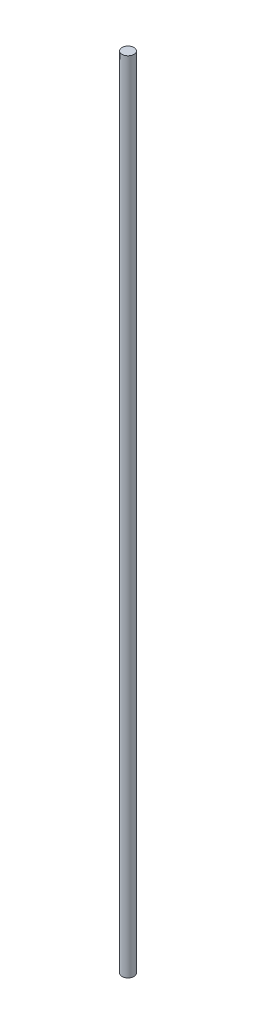
ISO-10303-21;
HEADER;
FILE_DESCRIPTION(('STEP AP214'),'2;1');
FILE_NAME('part.step','',(''),(''),'','','');
FILE_SCHEMA(('AUTOMOTIVE_DESIGN { 1 0 10303 214 1 1 1 1 }'));
ENDSEC;
DATA;
#1=APPLICATION_CONTEXT('core data for automotive mechanical design processes');
#2=APPLICATION_PROTOCOL_DEFINITION('international standard','automotive_design',2000,#1);
#3=PRODUCT_CONTEXT('',#1,'mechanical');
#4=PRODUCT('Part','Part','',(#3));
#5=PRODUCT_RELATED_PRODUCT_CATEGORY('part','',(#4));
#6=PRODUCT_DEFINITION_FORMATION('','',#4);
#7=PRODUCT_DEFINITION_CONTEXT('part definition',#1,'design');
#8=PRODUCT_DEFINITION('design','',#6,#7);
#9=PRODUCT_DEFINITION_SHAPE('','',#8);
#10=(LENGTH_UNIT() NAMED_UNIT(*) SI_UNIT(.MILLI.,.METRE.));
#11=(NAMED_UNIT(*) PLANE_ANGLE_UNIT() SI_UNIT($,.RADIAN.));
#12=(NAMED_UNIT(*) SI_UNIT($,.STERADIAN.) SOLID_ANGLE_UNIT());
#13=UNCERTAINTY_MEASURE_WITH_UNIT(LENGTH_MEASURE(1.E-05),#10,'distance_accuracy_value','');
#14=(GEOMETRIC_REPRESENTATION_CONTEXT(3) GLOBAL_UNCERTAINTY_ASSIGNED_CONTEXT((#13)) GLOBAL_UNIT_ASSIGNED_CONTEXT((#10,
#11,#12)) REPRESENTATION_CONTEXT('',''));
#15=CARTESIAN_POINT('',(0.,0.,0.));
#16=DIRECTION('',(0.,0.,1.));
#17=DIRECTION('',(1.,0.,0.));
#18=AXIS2_PLACEMENT_3D('',#15,#16,#17);
#19=CARTESIAN_POINT('',(0.,200.,0.));
#20=DIRECTION('',(0.,-1.,0.));
#21=DIRECTION('',(0.,0.,-1.));
#22=AXIS2_PLACEMENT_3D('',#19,#20,#21);
#23=CYLINDRICAL_SURFACE('',#22,1.5);
#24=CARTESIAN_POINT('',(0.,200.,0.));
#25=DIRECTION('',(0.,1.,0.));
#26=DIRECTION('',(0.,0.,1.));
#27=AXIS2_PLACEMENT_3D('',#24,#25,#26);
#28=CIRCLE('',#27,1.5);
#29=CARTESIAN_POINT('',(0.,200.,1.5));
#30=VERTEX_POINT('',#29);
#31=EDGE_CURVE('E10',#30,#30,#28,.T.);
#32=ORIENTED_EDGE('',*,*,#31,.F.);
#33=EDGE_LOOP('',(#32));
#34=FACE_BOUND('',#33,.T.);
#35=CARTESIAN_POINT('',(0.,0.,0.));
#36=DIRECTION('',(0.,1.,0.));
#37=DIRECTION('',(0.,0.,1.));
#38=AXIS2_PLACEMENT_3D('',#35,#36,#37);
#39=CIRCLE('',#38,1.5);
#40=CARTESIAN_POINT('',(0.,0.,1.5));
#41=VERTEX_POINT('',#40);
#42=EDGE_CURVE('E44',#41,#41,#39,.T.);
#43=ORIENTED_EDGE('',*,*,#42,.T.);
#44=EDGE_LOOP('',(#43));
#45=FACE_BOUND('',#44,.T.);
#46=ADVANCED_FACE('F41',(#34,#45),#23,.T.);
#47=CARTESIAN_POINT('',(0.,200.,0.));
#48=DIRECTION('',(0.,1.,0.));
#49=DIRECTION('',(0.,0.,1.));
#50=AXIS2_PLACEMENT_3D('',#47,#48,#49);
#51=PLANE('',#50);
#52=ORIENTED_EDGE('',*,*,#31,.T.);
#53=EDGE_LOOP('',(#52));
#54=FACE_BOUND('',#53,.T.);
#55=ADVANCED_FACE('F58',(#54),#51,.T.);
#56=CARTESIAN_POINT('',(0.,0.,0.));
#57=DIRECTION('',(0.,1.,0.));
#58=DIRECTION('',(0.,0.,1.));
#59=AXIS2_PLACEMENT_3D('',#56,#57,#58);
#60=PLANE('',#59);
#61=ORIENTED_EDGE('',*,*,#42,.F.);
#62=EDGE_LOOP('',(#61));
#63=FACE_BOUND('',#62,.T.);
#64=ADVANCED_FACE('F56',(#63),#60,.F.);
#65=CLOSED_SHELL('',(#46,#55,#64));
#66=MANIFOLD_SOLID_BREP('B2',#65);
#67=ADVANCED_BREP_SHAPE_REPRESENTATION('',(#18,#66),#14);
#68=SHAPE_DEFINITION_REPRESENTATION(#9,#67);
ENDSEC;
END-ISO-10303-21;
